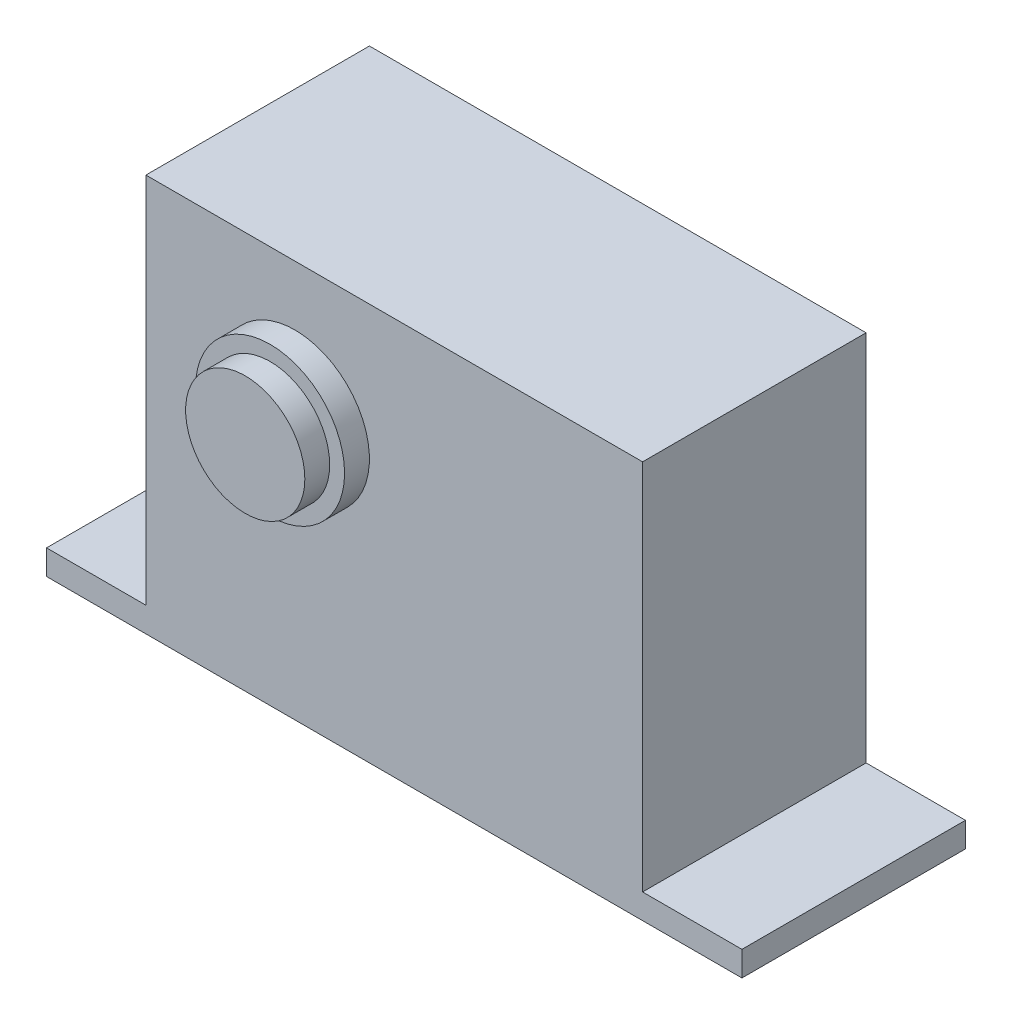
ISO-10303-21;
HEADER;
FILE_DESCRIPTION(('STEP AP214'),'2;1');
FILE_NAME('part.step','',(''),(''),'','','');
FILE_SCHEMA(('AUTOMOTIVE_DESIGN { 1 0 10303 214 1 1 1 1 }'));
ENDSEC;
DATA;
#1=APPLICATION_CONTEXT('core data for automotive mechanical design processes');
#2=APPLICATION_PROTOCOL_DEFINITION('international standard','automotive_design',2000,#1);
#3=PRODUCT_CONTEXT('',#1,'mechanical');
#4=PRODUCT('Part','Part','',(#3));
#5=PRODUCT_RELATED_PRODUCT_CATEGORY('part','',(#4));
#6=PRODUCT_DEFINITION_FORMATION('','',#4);
#7=PRODUCT_DEFINITION_CONTEXT('part definition',#1,'design');
#8=PRODUCT_DEFINITION('design','',#6,#7);
#9=PRODUCT_DEFINITION_SHAPE('','',#8);
#10=(LENGTH_UNIT() NAMED_UNIT(*) SI_UNIT(.MILLI.,.METRE.));
#11=(NAMED_UNIT(*) PLANE_ANGLE_UNIT() SI_UNIT($,.RADIAN.));
#12=(NAMED_UNIT(*) SI_UNIT($,.STERADIAN.) SOLID_ANGLE_UNIT());
#13=UNCERTAINTY_MEASURE_WITH_UNIT(LENGTH_MEASURE(1.E-05),#10,'distance_accuracy_value','');
#14=(GEOMETRIC_REPRESENTATION_CONTEXT(3) GLOBAL_UNCERTAINTY_ASSIGNED_CONTEXT((#13)) GLOBAL_UNIT_ASSIGNED_CONTEXT((#10,
#11,#12)) REPRESENTATION_CONTEXT('',''));
#15=CARTESIAN_POINT('',(0.,0.,0.));
#16=DIRECTION('',(0.,0.,1.));
#17=DIRECTION('',(1.,0.,0.));
#18=AXIS2_PLACEMENT_3D('',#15,#16,#17);
#19=CARTESIAN_POINT('',(0.,40.,22.5));
#20=DIRECTION('',(0.,-1.,0.));
#21=DIRECTION('',(0.,0.,-1.));
#22=AXIS2_PLACEMENT_3D('',#19,#20,#21);
#23=PLANE('',#22);
#24=DIRECTION('',(-1.,0.,0.));
#25=VECTOR('',#24,1.);
#26=CARTESIAN_POINT('',(0.,40.,22.5));
#27=LINE('',#26,#25);
#28=CARTESIAN_POINT('',(60.,40.,22.5));
#29=VERTEX_POINT('',#28);
#30=CARTESIAN_POINT('',(10.,40.,22.5));
#31=VERTEX_POINT('',#30);
#32=EDGE_CURVE('E106',#29,#31,#27,.T.);
#33=ORIENTED_EDGE('',*,*,#32,.F.);
#34=DIRECTION('',(0.,0.,1.));
#35=VECTOR('',#34,1.);
#36=CARTESIAN_POINT('',(60.,40.,22.5));
#37=LINE('',#36,#35);
#38=CARTESIAN_POINT('',(60.,40.,0.));
#39=VERTEX_POINT('',#38);
#40=EDGE_CURVE('E100',#39,#29,#37,.T.);
#41=ORIENTED_EDGE('',*,*,#40,.F.);
#42=DIRECTION('',(-1.,0.,0.));
#43=VECTOR('',#42,1.);
#44=CARTESIAN_POINT('',(0.,40.,0.));
#45=LINE('',#44,#43);
#46=CARTESIAN_POINT('',(10.,40.,0.));
#47=VERTEX_POINT('',#46);
#48=EDGE_CURVE('E56',#39,#47,#45,.T.);
#49=ORIENTED_EDGE('',*,*,#48,.T.);
#50=DIRECTION('',(0.,0.,-1.));
#51=VECTOR('',#50,1.);
#52=CARTESIAN_POINT('',(10.,40.,0.));
#53=LINE('',#52,#51);
#54=EDGE_CURVE('E167',#31,#47,#53,.T.);
#55=ORIENTED_EDGE('',*,*,#54,.F.);
#56=EDGE_LOOP('',(#33,#41,#49,#55));
#57=FACE_BOUND('',#56,.T.);
#58=ADVANCED_FACE('F33',(#57),#23,.F.);
#59=CARTESIAN_POINT('',(25.,26.5,25.));
#60=DIRECTION('',(0.,0.,1.));
#61=DIRECTION('',(1.,0.,0.));
#62=AXIS2_PLACEMENT_3D('',#59,#60,#61);
#63=PLANE('',#62);
#64=CARTESIAN_POINT('',(25.,26.5,25.));
#65=DIRECTION('',(0.,0.,1.));
#66=DIRECTION('',(1.,0.,0.));
#67=AXIS2_PLACEMENT_3D('',#64,#65,#66);
#68=CIRCLE('',#67,7.5);
#69=CARTESIAN_POINT('',(32.5,26.5,25.));
#70=VERTEX_POINT('',#69);
#71=EDGE_CURVE('E138',#70,#70,#68,.T.);
#72=ORIENTED_EDGE('',*,*,#71,.T.);
#73=EDGE_LOOP('',(#72));
#74=FACE_BOUND('',#73,.T.);
#75=CARTESIAN_POINT('',(25.,26.5,25.));
#76=DIRECTION('',(0.,0.,1.));
#77=DIRECTION('',(1.,0.,0.));
#78=AXIS2_PLACEMENT_3D('',#75,#76,#77);
#79=CIRCLE('',#78,6.);
#80=CARTESIAN_POINT('',(31.,26.5,25.));
#81=VERTEX_POINT('',#80);
#82=EDGE_CURVE('E150',#81,#81,#79,.T.);
#83=ORIENTED_EDGE('',*,*,#82,.F.);
#84=EDGE_LOOP('',(#83));
#85=FACE_BOUND('',#84,.T.);
#86=ADVANCED_FACE('F197',(#74,#85),#63,.T.);
#87=CARTESIAN_POINT('',(0.,0.,22.5));
#88=DIRECTION('',(0.,0.,-1.));
#89=DIRECTION('',(-1.,0.,0.));
#90=AXIS2_PLACEMENT_3D('',#87,#88,#89);
#91=PLANE('',#90);
#92=DIRECTION('',(0.,1.,0.));
#93=VECTOR('',#92,1.);
#94=CARTESIAN_POINT('',(70.,0.,22.5));
#95=LINE('',#94,#93);
#96=CARTESIAN_POINT('',(70.,0.,22.5));
#97=VERTEX_POINT('',#96);
#98=CARTESIAN_POINT('',(70.,2.5,22.5));
#99=VERTEX_POINT('',#98);
#100=EDGE_CURVE('E143',#97,#99,#95,.T.);
#101=ORIENTED_EDGE('',*,*,#100,.T.);
#102=DIRECTION('',(1.,0.,0.));
#103=VECTOR('',#102,1.);
#104=CARTESIAN_POINT('',(60.,2.5,22.5));
#105=LINE('',#104,#103);
#106=CARTESIAN_POINT('',(60.,2.5,22.5));
#107=VERTEX_POINT('',#106);
#108=EDGE_CURVE('E163',#107,#99,#105,.T.);
#109=ORIENTED_EDGE('',*,*,#108,.F.);
#110=DIRECTION('',(0.,-1.,0.));
#111=VECTOR('',#110,1.);
#112=CARTESIAN_POINT('',(60.,2.5,22.5));
#113=LINE('',#112,#111);
#114=EDGE_CURVE('E107',#29,#107,#113,.T.);
#115=ORIENTED_EDGE('',*,*,#114,.F.);
#116=ORIENTED_EDGE('',*,*,#32,.T.);
#117=DIRECTION('',(0.,1.,0.));
#118=VECTOR('',#117,1.);
#119=CARTESIAN_POINT('',(10.,40.,22.5));
#120=LINE('',#119,#118);
#121=CARTESIAN_POINT('',(10.,2.5,22.5));
#122=VERTEX_POINT('',#121);
#123=EDGE_CURVE('E162',#122,#31,#120,.T.);
#124=ORIENTED_EDGE('',*,*,#123,.F.);
#125=DIRECTION('',(-1.,0.,0.));
#126=VECTOR('',#125,1.);
#127=CARTESIAN_POINT('',(10.,2.5,22.5));
#128=LINE('',#127,#126);
#129=CARTESIAN_POINT('',(0.,2.5,22.5));
#130=VERTEX_POINT('',#129);
#131=EDGE_CURVE('E153',#122,#130,#128,.T.);
#132=ORIENTED_EDGE('',*,*,#131,.T.);
#133=DIRECTION('',(0.,-1.,0.));
#134=VECTOR('',#133,1.);
#135=CARTESIAN_POINT('',(0.,0.,22.5));
#136=LINE('',#135,#134);
#137=CARTESIAN_POINT('',(0.,0.,22.5));
#138=VERTEX_POINT('',#137);
#139=EDGE_CURVE('E113',#130,#138,#136,.T.);
#140=ORIENTED_EDGE('',*,*,#139,.T.);
#141=DIRECTION('',(1.,0.,0.));
#142=VECTOR('',#141,1.);
#143=CARTESIAN_POINT('',(0.,0.,22.5));
#144=LINE('',#143,#142);
#145=EDGE_CURVE('E116',#138,#97,#144,.T.);
#146=ORIENTED_EDGE('',*,*,#145,.T.);
#147=EDGE_LOOP('',(#101,#109,#115,#116,#124,#132,#140,#146));
#148=FACE_BOUND('',#147,.T.);
#149=CARTESIAN_POINT('',(25.,26.5,22.5));
#150=DIRECTION('',(0.,0.,-1.));
#151=DIRECTION('',(-1.,0.,0.));
#152=AXIS2_PLACEMENT_3D('',#149,#150,#151);
#153=CIRCLE('',#152,7.5);
#154=CARTESIAN_POINT('',(17.5,26.5,22.5));
#155=VERTEX_POINT('',#154);
#156=EDGE_CURVE('E11',#155,#155,#153,.F.);
#157=ORIENTED_EDGE('',*,*,#156,.F.);
#158=EDGE_LOOP('',(#157));
#159=FACE_BOUND('',#158,.T.);
#160=ADVANCED_FACE('F179',(#148,#159),#91,.F.);
#161=CARTESIAN_POINT('',(0.,0.,22.5));
#162=DIRECTION('',(1.,0.,0.));
#163=DIRECTION('',(0.,0.,-1.));
#164=AXIS2_PLACEMENT_3D('',#161,#162,#163);
#165=PLANE('',#164);
#166=ORIENTED_EDGE('',*,*,#139,.F.);
#167=DIRECTION('',(0.,0.,1.));
#168=VECTOR('',#167,1.);
#169=CARTESIAN_POINT('',(0.,2.5,0.));
#170=LINE('',#169,#168);
#171=CARTESIAN_POINT('',(0.,2.5,0.));
#172=VERTEX_POINT('',#171);
#173=EDGE_CURVE('E137',#172,#130,#170,.T.);
#174=ORIENTED_EDGE('',*,*,#173,.F.);
#175=DIRECTION('',(0.,-1.,0.));
#176=VECTOR('',#175,1.);
#177=CARTESIAN_POINT('',(0.,0.,0.));
#178=LINE('',#177,#176);
#179=CARTESIAN_POINT('',(0.,0.,0.));
#180=VERTEX_POINT('',#179);
#181=EDGE_CURVE('E136',#172,#180,#178,.T.);
#182=ORIENTED_EDGE('',*,*,#181,.T.);
#183=DIRECTION('',(0.,0.,-1.));
#184=VECTOR('',#183,1.);
#185=CARTESIAN_POINT('',(0.,0.,22.5));
#186=LINE('',#185,#184);
#187=EDGE_CURVE('E41',#138,#180,#186,.T.);
#188=ORIENTED_EDGE('',*,*,#187,.F.);
#189=EDGE_LOOP('',(#166,#174,#182,#188));
#190=FACE_BOUND('',#189,.T.);
#191=ADVANCED_FACE('F35',(#190),#165,.F.);
#192=CARTESIAN_POINT('',(0.,0.,22.5));
#193=DIRECTION('',(0.,1.,0.));
#194=DIRECTION('',(0.,0.,1.));
#195=AXIS2_PLACEMENT_3D('',#192,#193,#194);
#196=PLANE('',#195);
#197=DIRECTION('',(1.,0.,0.));
#198=VECTOR('',#197,1.);
#199=CARTESIAN_POINT('',(0.,0.,0.));
#200=LINE('',#199,#198);
#201=CARTESIAN_POINT('',(70.,0.,0.));
#202=VERTEX_POINT('',#201);
#203=EDGE_CURVE('E119',#180,#202,#200,.T.);
#204=ORIENTED_EDGE('',*,*,#203,.T.);
#205=DIRECTION('',(0.,0.,-1.));
#206=VECTOR('',#205,1.);
#207=CARTESIAN_POINT('',(70.,0.,22.5));
#208=LINE('',#207,#206);
#209=EDGE_CURVE('E123',#97,#202,#208,.T.);
#210=ORIENTED_EDGE('',*,*,#209,.F.);
#211=ORIENTED_EDGE('',*,*,#145,.F.);
#212=ORIENTED_EDGE('',*,*,#187,.T.);
#213=EDGE_LOOP('',(#204,#210,#211,#212));
#214=FACE_BOUND('',#213,.T.);
#215=ADVANCED_FACE('F129',(#214),#196,.F.);
#216=CARTESIAN_POINT('',(70.,0.,22.5));
#217=DIRECTION('',(-1.,0.,0.));
#218=DIRECTION('',(0.,0.,1.));
#219=AXIS2_PLACEMENT_3D('',#216,#217,#218);
#220=PLANE('',#219);
#221=DIRECTION('',(0.,1.,0.));
#222=VECTOR('',#221,1.);
#223=CARTESIAN_POINT('',(70.,0.,0.));
#224=LINE('',#223,#222);
#225=CARTESIAN_POINT('',(70.,2.5,0.));
#226=VERTEX_POINT('',#225);
#227=EDGE_CURVE('E114',#202,#226,#224,.T.);
#228=ORIENTED_EDGE('',*,*,#227,.T.);
#229=DIRECTION('',(0.,0.,-1.));
#230=VECTOR('',#229,1.);
#231=CARTESIAN_POINT('',(70.,2.5,0.));
#232=LINE('',#231,#230);
#233=EDGE_CURVE('E174',#99,#226,#232,.T.);
#234=ORIENTED_EDGE('',*,*,#233,.F.);
#235=ORIENTED_EDGE('',*,*,#100,.F.);
#236=ORIENTED_EDGE('',*,*,#209,.T.);
#237=EDGE_LOOP('',(#228,#234,#235,#236));
#238=FACE_BOUND('',#237,.T.);
#239=ADVANCED_FACE('F186',(#238),#220,.F.);
#240=CARTESIAN_POINT('',(0.,0.,0.));
#241=DIRECTION('',(0.,0.,-1.));
#242=DIRECTION('',(-1.,0.,0.));
#243=AXIS2_PLACEMENT_3D('',#240,#241,#242);
#244=PLANE('',#243);
#245=DIRECTION('',(1.,0.,0.));
#246=VECTOR('',#245,1.);
#247=CARTESIAN_POINT('',(60.,2.5,0.));
#248=LINE('',#247,#246);
#249=CARTESIAN_POINT('',(60.,2.5,0.));
#250=VERTEX_POINT('',#249);
#251=EDGE_CURVE('E171',#250,#226,#248,.T.);
#252=ORIENTED_EDGE('',*,*,#251,.T.);
#253=ORIENTED_EDGE('',*,*,#227,.F.);
#254=ORIENTED_EDGE('',*,*,#203,.F.);
#255=ORIENTED_EDGE('',*,*,#181,.F.);
#256=DIRECTION('',(-1.,0.,0.));
#257=VECTOR('',#256,1.);
#258=CARTESIAN_POINT('',(10.,2.5,0.));
#259=LINE('',#258,#257);
#260=CARTESIAN_POINT('',(10.,2.5,0.));
#261=VERTEX_POINT('',#260);
#262=EDGE_CURVE('E156',#261,#172,#259,.T.);
#263=ORIENTED_EDGE('',*,*,#262,.F.);
#264=DIRECTION('',(0.,-1.,0.));
#265=VECTOR('',#264,1.);
#266=CARTESIAN_POINT('',(10.,2.5,0.));
#267=LINE('',#266,#265);
#268=EDGE_CURVE('E112',#47,#261,#267,.T.);
#269=ORIENTED_EDGE('',*,*,#268,.F.);
#270=ORIENTED_EDGE('',*,*,#48,.F.);
#271=DIRECTION('',(0.,1.,0.));
#272=VECTOR('',#271,1.);
#273=CARTESIAN_POINT('',(60.,40.,0.));
#274=LINE('',#273,#272);
#275=EDGE_CURVE('E98',#250,#39,#274,.T.);
#276=ORIENTED_EDGE('',*,*,#275,.F.);
#277=EDGE_LOOP('',(#252,#253,#254,#255,#263,#269,#270,#276));
#278=FACE_BOUND('',#277,.T.);
#279=ADVANCED_FACE('F110',(#278),#244,.T.);
#280=CARTESIAN_POINT('',(25.,26.5,25.));
#281=DIRECTION('',(0.,0.,-1.));
#282=DIRECTION('',(-1.,0.,0.));
#283=AXIS2_PLACEMENT_3D('',#280,#281,#282);
#284=CYLINDRICAL_SURFACE('',#283,7.5);
#285=ORIENTED_EDGE('',*,*,#71,.F.);
#286=EDGE_LOOP('',(#285));
#287=FACE_BOUND('',#286,.T.);
#288=ORIENTED_EDGE('',*,*,#156,.T.);
#289=EDGE_LOOP('',(#288));
#290=FACE_BOUND('',#289,.T.);
#291=ADVANCED_FACE('F193',(#287,#290),#284,.T.);
#292=CARTESIAN_POINT('',(25.,26.5,27.5));
#293=DIRECTION('',(0.,0.,-1.));
#294=DIRECTION('',(-1.,0.,0.));
#295=AXIS2_PLACEMENT_3D('',#292,#293,#294);
#296=CYLINDRICAL_SURFACE('',#295,6.);
#297=CARTESIAN_POINT('',(25.,26.5,27.5));
#298=DIRECTION('',(0.,0.,1.));
#299=DIRECTION('',(1.,0.,0.));
#300=AXIS2_PLACEMENT_3D('',#297,#298,#299);
#301=CIRCLE('',#300,6.);
#302=CARTESIAN_POINT('',(31.,26.5,27.5));
#303=VERTEX_POINT('',#302);
#304=EDGE_CURVE('E149',#303,#303,#301,.T.);
#305=ORIENTED_EDGE('',*,*,#304,.F.);
#306=EDGE_LOOP('',(#305));
#307=FACE_BOUND('',#306,.T.);
#308=ORIENTED_EDGE('',*,*,#82,.T.);
#309=EDGE_LOOP('',(#308));
#310=FACE_BOUND('',#309,.T.);
#311=ADVANCED_FACE('F207',(#307,#310),#296,.T.);
#312=CARTESIAN_POINT('',(25.,26.5,27.5));
#313=DIRECTION('',(0.,0.,1.));
#314=DIRECTION('',(1.,0.,0.));
#315=AXIS2_PLACEMENT_3D('',#312,#313,#314);
#316=PLANE('',#315);
#317=ORIENTED_EDGE('',*,*,#304,.T.);
#318=EDGE_LOOP('',(#317));
#319=FACE_BOUND('',#318,.T.);
#320=ADVANCED_FACE('F212',(#319),#316,.T.);
#321=CARTESIAN_POINT('',(10.,2.5,0.));
#322=DIRECTION('',(0.,-1.,0.));
#323=DIRECTION('',(0.,0.,-1.));
#324=AXIS2_PLACEMENT_3D('',#321,#322,#323);
#325=PLANE('',#324);
#326=ORIENTED_EDGE('',*,*,#173,.T.);
#327=ORIENTED_EDGE('',*,*,#131,.F.);
#328=DIRECTION('',(0.,0.,1.));
#329=VECTOR('',#328,1.);
#330=CARTESIAN_POINT('',(10.,2.5,0.));
#331=LINE('',#330,#329);
#332=EDGE_CURVE('E158',#261,#122,#331,.T.);
#333=ORIENTED_EDGE('',*,*,#332,.F.);
#334=ORIENTED_EDGE('',*,*,#262,.T.);
#335=EDGE_LOOP('',(#326,#327,#333,#334));
#336=FACE_BOUND('',#335,.T.);
#337=ADVANCED_FACE('F216',(#336),#325,.F.);
#338=CARTESIAN_POINT('',(10.,0.,0.));
#339=DIRECTION('',(-1.,0.,0.));
#340=DIRECTION('',(0.,0.,1.));
#341=AXIS2_PLACEMENT_3D('',#338,#339,#340);
#342=PLANE('',#341);
#343=ORIENTED_EDGE('',*,*,#123,.T.);
#344=ORIENTED_EDGE('',*,*,#54,.T.);
#345=ORIENTED_EDGE('',*,*,#268,.T.);
#346=ORIENTED_EDGE('',*,*,#332,.T.);
#347=EDGE_LOOP('',(#343,#344,#345,#346));
#348=FACE_BOUND('',#347,.T.);
#349=ADVANCED_FACE('F220',(#348),#342,.T.);
#350=CARTESIAN_POINT('',(60.,2.5,0.));
#351=DIRECTION('',(0.,-1.,0.));
#352=DIRECTION('',(0.,0.,-1.));
#353=AXIS2_PLACEMENT_3D('',#350,#351,#352);
#354=PLANE('',#353);
#355=ORIENTED_EDGE('',*,*,#233,.T.);
#356=ORIENTED_EDGE('',*,*,#251,.F.);
#357=DIRECTION('',(0.,0.,-1.));
#358=VECTOR('',#357,1.);
#359=CARTESIAN_POINT('',(60.,2.5,0.));
#360=LINE('',#359,#358);
#361=EDGE_CURVE('E48',#107,#250,#360,.T.);
#362=ORIENTED_EDGE('',*,*,#361,.F.);
#363=ORIENTED_EDGE('',*,*,#108,.T.);
#364=EDGE_LOOP('',(#355,#356,#362,#363));
#365=FACE_BOUND('',#364,.T.);
#366=ADVANCED_FACE('F184',(#365),#354,.F.);
#367=CARTESIAN_POINT('',(60.,0.,0.));
#368=DIRECTION('',(-1.,0.,0.));
#369=DIRECTION('',(0.,0.,1.));
#370=AXIS2_PLACEMENT_3D('',#367,#368,#369);
#371=PLANE('',#370);
#372=ORIENTED_EDGE('',*,*,#361,.T.);
#373=ORIENTED_EDGE('',*,*,#275,.T.);
#374=ORIENTED_EDGE('',*,*,#40,.T.);
#375=ORIENTED_EDGE('',*,*,#114,.T.);
#376=EDGE_LOOP('',(#372,#373,#374,#375));
#377=FACE_BOUND('',#376,.T.);
#378=ADVANCED_FACE('F99',(#377),#371,.F.);
#379=CLOSED_SHELL('',(#58,#86,#160,#191,#215,#239,#279,#291,#311,#320,#337,#349,#366,#378));
#380=MANIFOLD_SOLID_BREP('B2',#379);
#381=ADVANCED_BREP_SHAPE_REPRESENTATION('',(#18,#380),#14);
#382=SHAPE_DEFINITION_REPRESENTATION(#9,#381);
ENDSEC;
END-ISO-10303-21;
